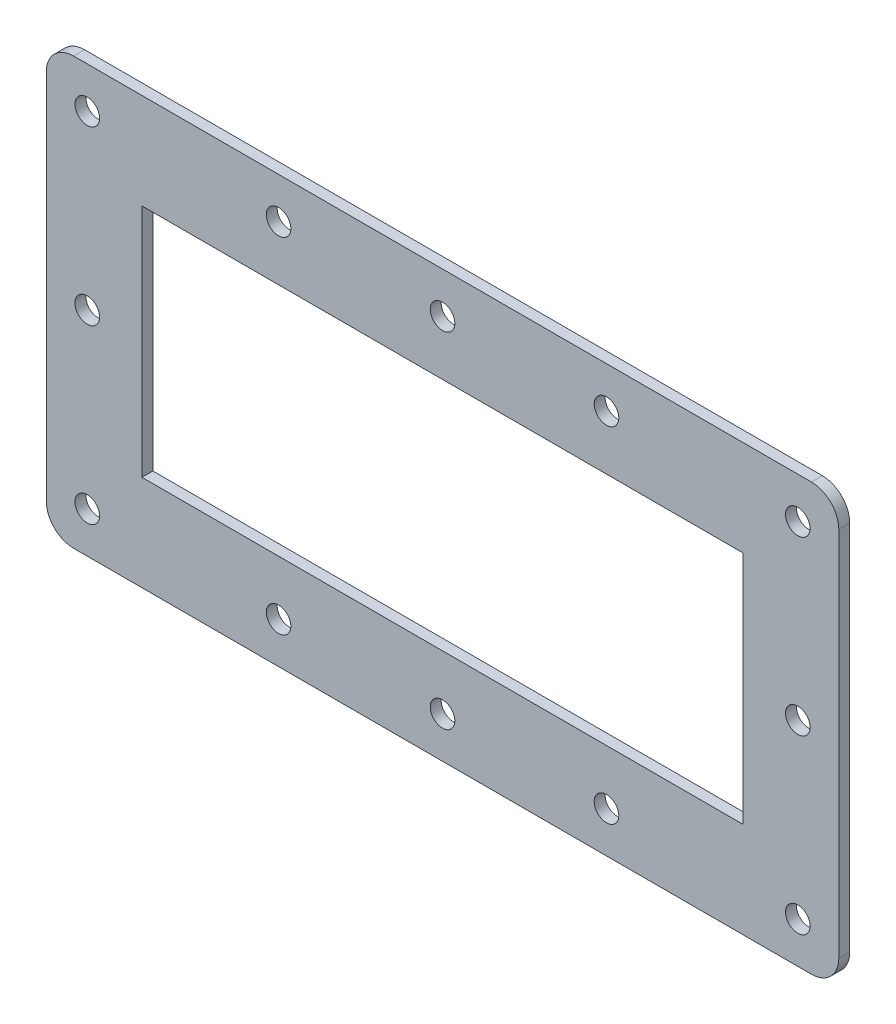
ISO-10303-21;
HEADER;
FILE_DESCRIPTION(('STEP AP214'),'2;1');
FILE_NAME('part.step','',(''),(''),'','','');
FILE_SCHEMA(('AUTOMOTIVE_DESIGN { 1 0 10303 214 1 1 1 1 }'));
ENDSEC;
DATA;
#1=APPLICATION_CONTEXT('core data for automotive mechanical design processes');
#2=APPLICATION_PROTOCOL_DEFINITION('international standard','automotive_design',2000,#1);
#3=PRODUCT_CONTEXT('',#1,'mechanical');
#4=PRODUCT('Part','Part','',(#3));
#5=PRODUCT_RELATED_PRODUCT_CATEGORY('part','',(#4));
#6=PRODUCT_DEFINITION_FORMATION('','',#4);
#7=PRODUCT_DEFINITION_CONTEXT('part definition',#1,'design');
#8=PRODUCT_DEFINITION('design','',#6,#7);
#9=PRODUCT_DEFINITION_SHAPE('','',#8);
#10=(LENGTH_UNIT() NAMED_UNIT(*) SI_UNIT(.MILLI.,.METRE.));
#11=(NAMED_UNIT(*) PLANE_ANGLE_UNIT() SI_UNIT($,.RADIAN.));
#12=(NAMED_UNIT(*) SI_UNIT($,.STERADIAN.) SOLID_ANGLE_UNIT());
#13=UNCERTAINTY_MEASURE_WITH_UNIT(LENGTH_MEASURE(1.E-05),#10,'distance_accuracy_value','');
#14=(GEOMETRIC_REPRESENTATION_CONTEXT(3) GLOBAL_UNCERTAINTY_ASSIGNED_CONTEXT((#13)) GLOBAL_UNIT_ASSIGNED_CONTEXT((#10,
#11,#12)) REPRESENTATION_CONTEXT('',''));
#15=CARTESIAN_POINT('',(0.,0.,0.));
#16=DIRECTION('',(0.,0.,1.));
#17=DIRECTION('',(1.,0.,0.));
#18=AXIS2_PLACEMENT_3D('',#15,#16,#17);
#19=CARTESIAN_POINT('',(-145.,-78.,-4.));
#20=DIRECTION('',(-1.,0.,0.));
#21=DIRECTION('',(0.,0.,1.));
#22=AXIS2_PLACEMENT_3D('',#19,#20,#21);
#23=PLANE('',#22);
#24=DIRECTION('',(0.,-1.,0.));
#25=VECTOR('',#24,1.);
#26=CARTESIAN_POINT('',(-145.,-78.,-4.));
#27=LINE('',#26,#25);
#28=CARTESIAN_POINT('',(-145.,68.,-4.));
#29=VERTEX_POINT('',#28);
#30=CARTESIAN_POINT('',(-145.,-68.,-4.));
#31=VERTEX_POINT('',#30);
#32=EDGE_CURVE('E174',#29,#31,#27,.T.);
#33=ORIENTED_EDGE('',*,*,#32,.T.);
#34=DIRECTION('',(0.,0.,1.));
#35=VECTOR('',#34,1.);
#36=CARTESIAN_POINT('',(-145.,-68.,-4.));
#37=LINE('',#36,#35);
#38=CARTESIAN_POINT('',(-145.,-68.,0.));
#39=VERTEX_POINT('',#38);
#40=EDGE_CURVE('E198',#31,#39,#37,.T.);
#41=ORIENTED_EDGE('',*,*,#40,.T.);
#42=DIRECTION('',(0.,-1.,0.));
#43=VECTOR('',#42,1.);
#44=CARTESIAN_POINT('',(-145.,-78.,0.));
#45=LINE('',#44,#43);
#46=CARTESIAN_POINT('',(-145.,68.,0.));
#47=VERTEX_POINT('',#46);
#48=EDGE_CURVE('E170',#47,#39,#45,.T.);
#49=ORIENTED_EDGE('',*,*,#48,.F.);
#50=DIRECTION('',(0.,0.,1.));
#51=VECTOR('',#50,1.);
#52=CARTESIAN_POINT('',(-145.,68.,-4.));
#53=LINE('',#52,#51);
#54=EDGE_CURVE('E186',#47,#29,#53,.F.);
#55=ORIENTED_EDGE('',*,*,#54,.T.);
#56=EDGE_LOOP('',(#33,#41,#49,#55));
#57=FACE_BOUND('',#56,.T.);
#58=ADVANCED_FACE('F38',(#57),#23,.T.);
#59=CARTESIAN_POINT('',(145.,78.,-4.));
#60=DIRECTION('',(0.,1.,0.));
#61=DIRECTION('',(0.,0.,1.));
#62=AXIS2_PLACEMENT_3D('',#59,#60,#61);
#63=PLANE('',#62);
#64=DIRECTION('',(-1.,0.,0.));
#65=VECTOR('',#64,1.);
#66=CARTESIAN_POINT('',(145.,78.,0.));
#67=LINE('',#66,#65);
#68=CARTESIAN_POINT('',(135.,78.,0.));
#69=VERTEX_POINT('',#68);
#70=CARTESIAN_POINT('',(-135.,78.,0.));
#71=VERTEX_POINT('',#70);
#72=EDGE_CURVE('E178',#69,#71,#67,.T.);
#73=ORIENTED_EDGE('',*,*,#72,.F.);
#74=DIRECTION('',(0.,0.,1.));
#75=VECTOR('',#74,1.);
#76=CARTESIAN_POINT('',(135.,78.,-4.));
#77=LINE('',#76,#75);
#78=CARTESIAN_POINT('',(135.,78.,-4.));
#79=VERTEX_POINT('',#78);
#80=EDGE_CURVE('E11',#69,#79,#77,.F.);
#81=ORIENTED_EDGE('',*,*,#80,.T.);
#82=DIRECTION('',(-1.,0.,0.));
#83=VECTOR('',#82,1.);
#84=CARTESIAN_POINT('',(145.,78.,-4.));
#85=LINE('',#84,#83);
#86=CARTESIAN_POINT('',(-135.,78.,-4.));
#87=VERTEX_POINT('',#86);
#88=EDGE_CURVE('E183',#79,#87,#85,.T.);
#89=ORIENTED_EDGE('',*,*,#88,.T.);
#90=DIRECTION('',(0.,0.,1.));
#91=VECTOR('',#90,1.);
#92=CARTESIAN_POINT('',(-135.,78.,-4.));
#93=LINE('',#92,#91);
#94=EDGE_CURVE('E46',#87,#71,#93,.T.);
#95=ORIENTED_EDGE('',*,*,#94,.T.);
#96=EDGE_LOOP('',(#73,#81,#89,#95));
#97=FACE_BOUND('',#96,.T.);
#98=ADVANCED_FACE('F228',(#97),#63,.T.);
#99=CARTESIAN_POINT('',(145.,-78.,-4.));
#100=DIRECTION('',(1.,0.,0.));
#101=DIRECTION('',(0.,0.,-1.));
#102=AXIS2_PLACEMENT_3D('',#99,#100,#101);
#103=PLANE('',#102);
#104=DIRECTION('',(0.,1.,0.));
#105=VECTOR('',#104,1.);
#106=CARTESIAN_POINT('',(145.,-78.,0.));
#107=LINE('',#106,#105);
#108=CARTESIAN_POINT('',(145.,-68.,0.));
#109=VERTEX_POINT('',#108);
#110=CARTESIAN_POINT('',(145.,68.,0.));
#111=VERTEX_POINT('',#110);
#112=EDGE_CURVE('E192',#109,#111,#107,.T.);
#113=ORIENTED_EDGE('',*,*,#112,.F.);
#114=DIRECTION('',(0.,0.,1.));
#115=VECTOR('',#114,1.);
#116=CARTESIAN_POINT('',(145.,-68.,-4.));
#117=LINE('',#116,#115);
#118=CARTESIAN_POINT('',(145.,-68.,-4.));
#119=VERTEX_POINT('',#118);
#120=EDGE_CURVE('E60',#109,#119,#117,.F.);
#121=ORIENTED_EDGE('',*,*,#120,.T.);
#122=DIRECTION('',(0.,1.,0.));
#123=VECTOR('',#122,1.);
#124=CARTESIAN_POINT('',(145.,-78.,-4.));
#125=LINE('',#124,#123);
#126=CARTESIAN_POINT('',(145.,68.,-4.));
#127=VERTEX_POINT('',#126);
#128=EDGE_CURVE('E181',#119,#127,#125,.T.);
#129=ORIENTED_EDGE('',*,*,#128,.T.);
#130=DIRECTION('',(0.,0.,1.));
#131=VECTOR('',#130,1.);
#132=CARTESIAN_POINT('',(145.,68.,-4.));
#133=LINE('',#132,#131);
#134=EDGE_CURVE('E221',#127,#111,#133,.T.);
#135=ORIENTED_EDGE('',*,*,#134,.T.);
#136=EDGE_LOOP('',(#113,#121,#129,#135));
#137=FACE_BOUND('',#136,.T.);
#138=ADVANCED_FACE('F238',(#137),#103,.T.);
#139=CARTESIAN_POINT('',(145.,-78.,-4.));
#140=DIRECTION('',(0.,-1.,0.));
#141=DIRECTION('',(0.,0.,-1.));
#142=AXIS2_PLACEMENT_3D('',#139,#140,#141);
#143=PLANE('',#142);
#144=DIRECTION('',(1.,0.,0.));
#145=VECTOR('',#144,1.);
#146=CARTESIAN_POINT('',(145.,-78.,0.));
#147=LINE('',#146,#145);
#148=CARTESIAN_POINT('',(-135.,-78.,0.));
#149=VERTEX_POINT('',#148);
#150=CARTESIAN_POINT('',(135.,-78.,0.));
#151=VERTEX_POINT('',#150);
#152=EDGE_CURVE('E189',#149,#151,#147,.T.);
#153=ORIENTED_EDGE('',*,*,#152,.F.);
#154=DIRECTION('',(0.,0.,1.));
#155=VECTOR('',#154,1.);
#156=CARTESIAN_POINT('',(-135.,-78.,-4.));
#157=LINE('',#156,#155);
#158=CARTESIAN_POINT('',(-135.,-78.,-4.));
#159=VERTEX_POINT('',#158);
#160=EDGE_CURVE('E212',#149,#159,#157,.F.);
#161=ORIENTED_EDGE('',*,*,#160,.T.);
#162=DIRECTION('',(1.,0.,0.));
#163=VECTOR('',#162,1.);
#164=CARTESIAN_POINT('',(145.,-78.,-4.));
#165=LINE('',#164,#163);
#166=CARTESIAN_POINT('',(135.,-78.,-4.));
#167=VERTEX_POINT('',#166);
#168=EDGE_CURVE('E177',#159,#167,#165,.T.);
#169=ORIENTED_EDGE('',*,*,#168,.T.);
#170=DIRECTION('',(0.,0.,1.));
#171=VECTOR('',#170,1.);
#172=CARTESIAN_POINT('',(135.,-78.,-4.));
#173=LINE('',#172,#171);
#174=EDGE_CURVE('E209',#167,#151,#173,.T.);
#175=ORIENTED_EDGE('',*,*,#174,.T.);
#176=EDGE_LOOP('',(#153,#161,#169,#175));
#177=FACE_BOUND('',#176,.T.);
#178=ADVANCED_FACE('F246',(#177),#143,.T.);
#179=CARTESIAN_POINT('',(0.,0.,-4.));
#180=DIRECTION('',(0.,0.,1.));
#181=DIRECTION('',(1.,0.,0.));
#182=AXIS2_PLACEMENT_3D('',#179,#180,#181);
#183=PLANE('',#182);
#184=CARTESIAN_POINT('',(-60.,63.,-4.));
#185=DIRECTION('',(0.,0.,1.));
#186=DIRECTION('',(1.,0.,0.));
#187=AXIS2_PLACEMENT_3D('',#184,#185,#186);
#188=CIRCLE('',#187,4.49999999999999);
#189=CARTESIAN_POINT('',(-55.5,63.,-4.));
#190=VERTEX_POINT('',#189);
#191=EDGE_CURVE('E611',#190,#190,#188,.T.);
#192=ORIENTED_EDGE('',*,*,#191,.T.);
#193=EDGE_LOOP('',(#192));
#194=FACE_BOUND('',#193,.T.);
#195=CARTESIAN_POINT('',(0.,63.,-4.));
#196=DIRECTION('',(0.,0.,1.));
#197=DIRECTION('',(1.,0.,0.));
#198=AXIS2_PLACEMENT_3D('',#195,#196,#197);
#199=CIRCLE('',#198,4.49999999999999);
#200=CARTESIAN_POINT('',(4.49999999999999,63.,-4.));
#201=VERTEX_POINT('',#200);
#202=EDGE_CURVE('E605',#201,#201,#199,.T.);
#203=ORIENTED_EDGE('',*,*,#202,.T.);
#204=EDGE_LOOP('',(#203));
#205=FACE_BOUND('',#204,.T.);
#206=CARTESIAN_POINT('',(60.,63.,-4.));
#207=DIRECTION('',(0.,0.,1.));
#208=DIRECTION('',(1.,0.,0.));
#209=AXIS2_PLACEMENT_3D('',#206,#207,#208);
#210=CIRCLE('',#209,4.49999999999999);
#211=CARTESIAN_POINT('',(64.5,63.,-4.));
#212=VERTEX_POINT('',#211);
#213=EDGE_CURVE('E599',#212,#212,#210,.T.);
#214=ORIENTED_EDGE('',*,*,#213,.T.);
#215=EDGE_LOOP('',(#214));
#216=FACE_BOUND('',#215,.T.);
#217=CARTESIAN_POINT('',(-60.,-63.,-4.));
#218=DIRECTION('',(0.,0.,1.));
#219=DIRECTION('',(1.,0.,0.));
#220=AXIS2_PLACEMENT_3D('',#217,#218,#219);
#221=CIRCLE('',#220,4.49999999999999);
#222=CARTESIAN_POINT('',(-55.5,-63.,-4.));
#223=VERTEX_POINT('',#222);
#224=EDGE_CURVE('E593',#223,#223,#221,.T.);
#225=ORIENTED_EDGE('',*,*,#224,.T.);
#226=EDGE_LOOP('',(#225));
#227=FACE_BOUND('',#226,.T.);
#228=CARTESIAN_POINT('',(0.,-63.,-4.));
#229=DIRECTION('',(0.,0.,1.));
#230=DIRECTION('',(1.,0.,0.));
#231=AXIS2_PLACEMENT_3D('',#228,#229,#230);
#232=CIRCLE('',#231,4.49999999999999);
#233=CARTESIAN_POINT('',(4.49999999999999,-63.,-4.));
#234=VERTEX_POINT('',#233);
#235=EDGE_CURVE('E587',#234,#234,#232,.T.);
#236=ORIENTED_EDGE('',*,*,#235,.T.);
#237=EDGE_LOOP('',(#236));
#238=FACE_BOUND('',#237,.T.);
#239=CARTESIAN_POINT('',(60.,-63.,-4.));
#240=DIRECTION('',(0.,0.,1.));
#241=DIRECTION('',(1.,0.,0.));
#242=AXIS2_PLACEMENT_3D('',#239,#240,#241);
#243=CIRCLE('',#242,4.49999999999999);
#244=CARTESIAN_POINT('',(64.5,-63.,-4.));
#245=VERTEX_POINT('',#244);
#246=EDGE_CURVE('E581',#245,#245,#243,.T.);
#247=ORIENTED_EDGE('',*,*,#246,.T.);
#248=EDGE_LOOP('',(#247));
#249=FACE_BOUND('',#248,.T.);
#250=CARTESIAN_POINT('',(130.,63.,-4.));
#251=DIRECTION('',(0.,0.,1.));
#252=DIRECTION('',(1.,0.,0.));
#253=AXIS2_PLACEMENT_3D('',#250,#251,#252);
#254=CIRCLE('',#253,4.5);
#255=CARTESIAN_POINT('',(134.5,63.,-4.));
#256=VERTEX_POINT('',#255);
#257=EDGE_CURVE('E575',#256,#256,#254,.T.);
#258=ORIENTED_EDGE('',*,*,#257,.T.);
#259=EDGE_LOOP('',(#258));
#260=FACE_BOUND('',#259,.T.);
#261=CARTESIAN_POINT('',(130.,0.,-4.));
#262=DIRECTION('',(0.,0.,1.));
#263=DIRECTION('',(1.,0.,0.));
#264=AXIS2_PLACEMENT_3D('',#261,#262,#263);
#265=CIRCLE('',#264,4.5);
#266=CARTESIAN_POINT('',(134.5,0.,-4.));
#267=VERTEX_POINT('',#266);
#268=EDGE_CURVE('E569',#267,#267,#265,.T.);
#269=ORIENTED_EDGE('',*,*,#268,.T.);
#270=EDGE_LOOP('',(#269));
#271=FACE_BOUND('',#270,.T.);
#272=CARTESIAN_POINT('',(130.,-63.,-4.));
#273=DIRECTION('',(0.,0.,1.));
#274=DIRECTION('',(1.,0.,0.));
#275=AXIS2_PLACEMENT_3D('',#272,#273,#274);
#276=CIRCLE('',#275,4.5);
#277=CARTESIAN_POINT('',(134.5,-63.,-4.));
#278=VERTEX_POINT('',#277);
#279=EDGE_CURVE('E563',#278,#278,#276,.T.);
#280=ORIENTED_EDGE('',*,*,#279,.T.);
#281=EDGE_LOOP('',(#280));
#282=FACE_BOUND('',#281,.T.);
#283=CARTESIAN_POINT('',(-130.,63.,-4.));
#284=DIRECTION('',(0.,0.,1.));
#285=DIRECTION('',(1.,0.,0.));
#286=AXIS2_PLACEMENT_3D('',#283,#284,#285);
#287=CIRCLE('',#286,4.5);
#288=CARTESIAN_POINT('',(-125.5,63.,-4.));
#289=VERTEX_POINT('',#288);
#290=EDGE_CURVE('E543',#289,#289,#287,.T.);
#291=ORIENTED_EDGE('',*,*,#290,.T.);
#292=EDGE_LOOP('',(#291));
#293=FACE_BOUND('',#292,.T.);
#294=CARTESIAN_POINT('',(-130.,0.,-4.));
#295=DIRECTION('',(0.,0.,1.));
#296=DIRECTION('',(1.,0.,0.));
#297=AXIS2_PLACEMENT_3D('',#294,#295,#296);
#298=CIRCLE('',#297,4.5);
#299=CARTESIAN_POINT('',(-125.5,0.,-4.));
#300=VERTEX_POINT('',#299);
#301=EDGE_CURVE('E538',#300,#300,#298,.T.);
#302=ORIENTED_EDGE('',*,*,#301,.T.);
#303=EDGE_LOOP('',(#302));
#304=FACE_BOUND('',#303,.T.);
#305=CARTESIAN_POINT('',(-130.,-63.,-4.));
#306=DIRECTION('',(0.,0.,1.));
#307=DIRECTION('',(1.,0.,0.));
#308=AXIS2_PLACEMENT_3D('',#305,#306,#307);
#309=CIRCLE('',#308,4.5);
#310=CARTESIAN_POINT('',(-125.5,-63.,-4.));
#311=VERTEX_POINT('',#310);
#312=EDGE_CURVE('E158',#311,#311,#309,.T.);
#313=ORIENTED_EDGE('',*,*,#312,.T.);
#314=EDGE_LOOP('',(#313));
#315=FACE_BOUND('',#314,.T.);
#316=DIRECTION('',(-1.,0.,0.));
#317=VECTOR('',#316,1.);
#318=CARTESIAN_POINT('',(110.,43.,-4.));
#319=LINE('',#318,#317);
#320=CARTESIAN_POINT('',(110.,43.,-4.));
#321=VERTEX_POINT('',#320);
#322=CARTESIAN_POINT('',(-110.,43.,-4.));
#323=VERTEX_POINT('',#322);
#324=EDGE_CURVE('E140',#321,#323,#319,.T.);
#325=ORIENTED_EDGE('',*,*,#324,.T.);
#326=DIRECTION('',(0.,-1.,0.));
#327=VECTOR('',#326,1.);
#328=CARTESIAN_POINT('',(-110.,-43.,-4.));
#329=LINE('',#328,#327);
#330=CARTESIAN_POINT('',(-110.,-43.,-4.));
#331=VERTEX_POINT('',#330);
#332=EDGE_CURVE('E132',#323,#331,#329,.T.);
#333=ORIENTED_EDGE('',*,*,#332,.T.);
#334=DIRECTION('',(1.,0.,0.));
#335=VECTOR('',#334,1.);
#336=CARTESIAN_POINT('',(110.,-43.,-4.));
#337=LINE('',#336,#335);
#338=CARTESIAN_POINT('',(110.,-43.,-4.));
#339=VERTEX_POINT('',#338);
#340=EDGE_CURVE('E144',#331,#339,#337,.T.);
#341=ORIENTED_EDGE('',*,*,#340,.T.);
#342=DIRECTION('',(0.,1.,0.));
#343=VECTOR('',#342,1.);
#344=CARTESIAN_POINT('',(110.,-43.,-4.));
#345=LINE('',#344,#343);
#346=EDGE_CURVE('E148',#339,#321,#345,.T.);
#347=ORIENTED_EDGE('',*,*,#346,.T.);
#348=EDGE_LOOP('',(#325,#333,#341,#347));
#349=FACE_BOUND('',#348,.T.);
#350=ORIENTED_EDGE('',*,*,#168,.F.);
#351=CARTESIAN_POINT('',(-135.,-68.,-4.));
#352=DIRECTION('',(0.,0.,1.));
#353=DIRECTION('',(1.,0.,0.));
#354=AXIS2_PLACEMENT_3D('',#351,#352,#353);
#355=CIRCLE('',#354,10.);
#356=EDGE_CURVE('E219',#159,#31,#355,.F.);
#357=ORIENTED_EDGE('',*,*,#356,.T.);
#358=ORIENTED_EDGE('',*,*,#32,.F.);
#359=CARTESIAN_POINT('',(-135.,68.,-4.));
#360=DIRECTION('',(0.,0.,1.));
#361=DIRECTION('',(1.,0.,0.));
#362=AXIS2_PLACEMENT_3D('',#359,#360,#361);
#363=CIRCLE('',#362,10.);
#364=EDGE_CURVE('E214',#29,#87,#363,.F.);
#365=ORIENTED_EDGE('',*,*,#364,.T.);
#366=ORIENTED_EDGE('',*,*,#88,.F.);
#367=CARTESIAN_POINT('',(135.,68.,-4.));
#368=DIRECTION('',(0.,0.,1.));
#369=DIRECTION('',(1.,0.,0.));
#370=AXIS2_PLACEMENT_3D('',#367,#368,#369);
#371=CIRCLE('',#370,10.);
#372=EDGE_CURVE('E53',#79,#127,#371,.F.);
#373=ORIENTED_EDGE('',*,*,#372,.T.);
#374=ORIENTED_EDGE('',*,*,#128,.F.);
#375=CARTESIAN_POINT('',(135.,-68.,-4.));
#376=DIRECTION('',(0.,0.,1.));
#377=DIRECTION('',(1.,0.,0.));
#378=AXIS2_PLACEMENT_3D('',#375,#376,#377);
#379=CIRCLE('',#378,10.);
#380=EDGE_CURVE('E217',#119,#167,#379,.F.);
#381=ORIENTED_EDGE('',*,*,#380,.T.);
#382=EDGE_LOOP('',(#350,#357,#358,#365,#366,#373,#374,#381));
#383=FACE_BOUND('',#382,.T.);
#384=ADVANCED_FACE('F150',(#194,#205,#216,#227,#238,#249,#260,#271,#282,#293,#304,#315,#349,
#383),#183,.F.);
#385=CARTESIAN_POINT('',(0.,0.,0.));
#386=DIRECTION('',(0.,0.,1.));
#387=DIRECTION('',(1.,0.,0.));
#388=AXIS2_PLACEMENT_3D('',#385,#386,#387);
#389=PLANE('',#388);
#390=CARTESIAN_POINT('',(-60.,63.,0.));
#391=DIRECTION('',(0.,0.,1.));
#392=DIRECTION('',(1.,0.,0.));
#393=AXIS2_PLACEMENT_3D('',#390,#391,#392);
#394=CIRCLE('',#393,4.49999999999999);
#395=CARTESIAN_POINT('',(-55.5,63.,0.));
#396=VERTEX_POINT('',#395);
#397=EDGE_CURVE('E614',#396,#396,#394,.T.);
#398=ORIENTED_EDGE('',*,*,#397,.F.);
#399=EDGE_LOOP('',(#398));
#400=FACE_BOUND('',#399,.T.);
#401=CARTESIAN_POINT('',(0.,63.,0.));
#402=DIRECTION('',(0.,0.,1.));
#403=DIRECTION('',(1.,0.,0.));
#404=AXIS2_PLACEMENT_3D('',#401,#402,#403);
#405=CIRCLE('',#404,4.49999999999999);
#406=CARTESIAN_POINT('',(4.49999999999999,63.,0.));
#407=VERTEX_POINT('',#406);
#408=EDGE_CURVE('E608',#407,#407,#405,.T.);
#409=ORIENTED_EDGE('',*,*,#408,.F.);
#410=EDGE_LOOP('',(#409));
#411=FACE_BOUND('',#410,.T.);
#412=CARTESIAN_POINT('',(60.,63.,0.));
#413=DIRECTION('',(0.,0.,1.));
#414=DIRECTION('',(1.,0.,0.));
#415=AXIS2_PLACEMENT_3D('',#412,#413,#414);
#416=CIRCLE('',#415,4.49999999999999);
#417=CARTESIAN_POINT('',(64.5,63.,0.));
#418=VERTEX_POINT('',#417);
#419=EDGE_CURVE('E602',#418,#418,#416,.T.);
#420=ORIENTED_EDGE('',*,*,#419,.F.);
#421=EDGE_LOOP('',(#420));
#422=FACE_BOUND('',#421,.T.);
#423=CARTESIAN_POINT('',(-60.,-63.,0.));
#424=DIRECTION('',(0.,0.,1.));
#425=DIRECTION('',(1.,0.,0.));
#426=AXIS2_PLACEMENT_3D('',#423,#424,#425);
#427=CIRCLE('',#426,4.49999999999999);
#428=CARTESIAN_POINT('',(-55.5,-63.,0.));
#429=VERTEX_POINT('',#428);
#430=EDGE_CURVE('E596',#429,#429,#427,.T.);
#431=ORIENTED_EDGE('',*,*,#430,.F.);
#432=EDGE_LOOP('',(#431));
#433=FACE_BOUND('',#432,.T.);
#434=CARTESIAN_POINT('',(0.,-63.,0.));
#435=DIRECTION('',(0.,0.,1.));
#436=DIRECTION('',(1.,0.,0.));
#437=AXIS2_PLACEMENT_3D('',#434,#435,#436);
#438=CIRCLE('',#437,4.49999999999999);
#439=CARTESIAN_POINT('',(4.49999999999999,-63.,0.));
#440=VERTEX_POINT('',#439);
#441=EDGE_CURVE('E590',#440,#440,#438,.T.);
#442=ORIENTED_EDGE('',*,*,#441,.F.);
#443=EDGE_LOOP('',(#442));
#444=FACE_BOUND('',#443,.T.);
#445=CARTESIAN_POINT('',(60.,-63.,0.));
#446=DIRECTION('',(0.,0.,1.));
#447=DIRECTION('',(1.,0.,0.));
#448=AXIS2_PLACEMENT_3D('',#445,#446,#447);
#449=CIRCLE('',#448,4.49999999999999);
#450=CARTESIAN_POINT('',(64.5,-63.,0.));
#451=VERTEX_POINT('',#450);
#452=EDGE_CURVE('E584',#451,#451,#449,.T.);
#453=ORIENTED_EDGE('',*,*,#452,.F.);
#454=EDGE_LOOP('',(#453));
#455=FACE_BOUND('',#454,.T.);
#456=CARTESIAN_POINT('',(130.,63.,0.));
#457=DIRECTION('',(0.,0.,1.));
#458=DIRECTION('',(1.,0.,0.));
#459=AXIS2_PLACEMENT_3D('',#456,#457,#458);
#460=CIRCLE('',#459,4.5);
#461=CARTESIAN_POINT('',(134.5,63.,0.));
#462=VERTEX_POINT('',#461);
#463=EDGE_CURVE('E578',#462,#462,#460,.T.);
#464=ORIENTED_EDGE('',*,*,#463,.F.);
#465=EDGE_LOOP('',(#464));
#466=FACE_BOUND('',#465,.T.);
#467=CARTESIAN_POINT('',(130.,0.,0.));
#468=DIRECTION('',(0.,0.,1.));
#469=DIRECTION('',(1.,0.,0.));
#470=AXIS2_PLACEMENT_3D('',#467,#468,#469);
#471=CIRCLE('',#470,4.5);
#472=CARTESIAN_POINT('',(134.5,0.,0.));
#473=VERTEX_POINT('',#472);
#474=EDGE_CURVE('E572',#473,#473,#471,.T.);
#475=ORIENTED_EDGE('',*,*,#474,.F.);
#476=EDGE_LOOP('',(#475));
#477=FACE_BOUND('',#476,.T.);
#478=CARTESIAN_POINT('',(130.,-63.,0.));
#479=DIRECTION('',(0.,0.,1.));
#480=DIRECTION('',(1.,0.,0.));
#481=AXIS2_PLACEMENT_3D('',#478,#479,#480);
#482=CIRCLE('',#481,4.5);
#483=CARTESIAN_POINT('',(134.5,-63.,0.));
#484=VERTEX_POINT('',#483);
#485=EDGE_CURVE('E566',#484,#484,#482,.T.);
#486=ORIENTED_EDGE('',*,*,#485,.F.);
#487=EDGE_LOOP('',(#486));
#488=FACE_BOUND('',#487,.T.);
#489=CARTESIAN_POINT('',(-130.,63.,0.));
#490=DIRECTION('',(0.,0.,1.));
#491=DIRECTION('',(1.,0.,0.));
#492=AXIS2_PLACEMENT_3D('',#489,#490,#491);
#493=CIRCLE('',#492,4.5);
#494=CARTESIAN_POINT('',(-125.5,63.,0.));
#495=VERTEX_POINT('',#494);
#496=EDGE_CURVE('E548',#495,#495,#493,.T.);
#497=ORIENTED_EDGE('',*,*,#496,.F.);
#498=EDGE_LOOP('',(#497));
#499=FACE_BOUND('',#498,.T.);
#500=CARTESIAN_POINT('',(-130.,0.,0.));
#501=DIRECTION('',(0.,0.,1.));
#502=DIRECTION('',(1.,0.,0.));
#503=AXIS2_PLACEMENT_3D('',#500,#501,#502);
#504=CIRCLE('',#503,4.5);
#505=CARTESIAN_POINT('',(-125.5,0.,0.));
#506=VERTEX_POINT('',#505);
#507=EDGE_CURVE('E541',#506,#506,#504,.T.);
#508=ORIENTED_EDGE('',*,*,#507,.F.);
#509=EDGE_LOOP('',(#508));
#510=FACE_BOUND('',#509,.T.);
#511=CARTESIAN_POINT('',(-130.,-63.,0.));
#512=DIRECTION('',(0.,0.,1.));
#513=DIRECTION('',(1.,0.,0.));
#514=AXIS2_PLACEMENT_3D('',#511,#512,#513);
#515=CIRCLE('',#514,4.5);
#516=CARTESIAN_POINT('',(-125.5,-63.,0.));
#517=VERTEX_POINT('',#516);
#518=EDGE_CURVE('E545',#517,#517,#515,.T.);
#519=ORIENTED_EDGE('',*,*,#518,.F.);
#520=EDGE_LOOP('',(#519));
#521=FACE_BOUND('',#520,.T.);
#522=DIRECTION('',(0.,-1.,0.));
#523=VECTOR('',#522,1.);
#524=CARTESIAN_POINT('',(-110.,-43.,0.));
#525=LINE('',#524,#523);
#526=CARTESIAN_POINT('',(-110.,43.,0.));
#527=VERTEX_POINT('',#526);
#528=CARTESIAN_POINT('',(-110.,-43.,0.));
#529=VERTEX_POINT('',#528);
#530=EDGE_CURVE('E135',#527,#529,#525,.T.);
#531=ORIENTED_EDGE('',*,*,#530,.F.);
#532=DIRECTION('',(-1.,0.,0.));
#533=VECTOR('',#532,1.);
#534=CARTESIAN_POINT('',(110.,43.,0.));
#535=LINE('',#534,#533);
#536=CARTESIAN_POINT('',(110.,43.,0.));
#537=VERTEX_POINT('',#536);
#538=EDGE_CURVE('E152',#537,#527,#535,.T.);
#539=ORIENTED_EDGE('',*,*,#538,.F.);
#540=DIRECTION('',(0.,1.,0.));
#541=VECTOR('',#540,1.);
#542=CARTESIAN_POINT('',(110.,-43.,0.));
#543=LINE('',#542,#541);
#544=CARTESIAN_POINT('',(110.,-43.,0.));
#545=VERTEX_POINT('',#544);
#546=EDGE_CURVE('E155',#545,#537,#543,.T.);
#547=ORIENTED_EDGE('',*,*,#546,.F.);
#548=DIRECTION('',(1.,0.,0.));
#549=VECTOR('',#548,1.);
#550=CARTESIAN_POINT('',(110.,-43.,0.));
#551=LINE('',#550,#549);
#552=EDGE_CURVE('E164',#529,#545,#551,.T.);
#553=ORIENTED_EDGE('',*,*,#552,.F.);
#554=EDGE_LOOP('',(#531,#539,#547,#553));
#555=FACE_BOUND('',#554,.T.);
#556=ORIENTED_EDGE('',*,*,#48,.T.);
#557=CARTESIAN_POINT('',(-135.,-68.,0.));
#558=DIRECTION('',(0.,0.,1.));
#559=DIRECTION('',(1.,0.,0.));
#560=AXIS2_PLACEMENT_3D('',#557,#558,#559);
#561=CIRCLE('',#560,10.);
#562=EDGE_CURVE('E207',#39,#149,#561,.T.);
#563=ORIENTED_EDGE('',*,*,#562,.T.);
#564=ORIENTED_EDGE('',*,*,#152,.T.);
#565=CARTESIAN_POINT('',(135.,-68.,0.));
#566=DIRECTION('',(0.,0.,1.));
#567=DIRECTION('',(1.,0.,0.));
#568=AXIS2_PLACEMENT_3D('',#565,#566,#567);
#569=CIRCLE('',#568,10.);
#570=EDGE_CURVE('E205',#151,#109,#569,.T.);
#571=ORIENTED_EDGE('',*,*,#570,.T.);
#572=ORIENTED_EDGE('',*,*,#112,.T.);
#573=CARTESIAN_POINT('',(135.,68.,0.));
#574=DIRECTION('',(0.,0.,1.));
#575=DIRECTION('',(1.,0.,0.));
#576=AXIS2_PLACEMENT_3D('',#573,#574,#575);
#577=CIRCLE('',#576,10.);
#578=EDGE_CURVE('E203',#111,#69,#577,.T.);
#579=ORIENTED_EDGE('',*,*,#578,.T.);
#580=ORIENTED_EDGE('',*,*,#72,.T.);
#581=CARTESIAN_POINT('',(-135.,68.,0.));
#582=DIRECTION('',(0.,0.,1.));
#583=DIRECTION('',(1.,0.,0.));
#584=AXIS2_PLACEMENT_3D('',#581,#582,#583);
#585=CIRCLE('',#584,10.);
#586=EDGE_CURVE('E201',#71,#47,#585,.T.);
#587=ORIENTED_EDGE('',*,*,#586,.T.);
#588=EDGE_LOOP('',(#556,#563,#564,#571,#572,#579,#580,#587));
#589=FACE_BOUND('',#588,.T.);
#590=ADVANCED_FACE('F233',(#400,#411,#422,#433,#444,#455,#466,#477,#488,#499,#510,#521,#555,
#589),#389,.T.);
#591=CARTESIAN_POINT('',(-110.,-43.,-4.));
#592=DIRECTION('',(-1.,0.,0.));
#593=DIRECTION('',(0.,0.,1.));
#594=AXIS2_PLACEMENT_3D('',#591,#592,#593);
#595=PLANE('',#594);
#596=ORIENTED_EDGE('',*,*,#530,.T.);
#597=DIRECTION('',(0.,0.,1.));
#598=VECTOR('',#597,1.);
#599=CARTESIAN_POINT('',(-110.,-43.,-4.));
#600=LINE('',#599,#598);
#601=EDGE_CURVE('E128',#331,#529,#600,.T.);
#602=ORIENTED_EDGE('',*,*,#601,.F.);
#603=ORIENTED_EDGE('',*,*,#332,.F.);
#604=DIRECTION('',(0.,0.,1.));
#605=VECTOR('',#604,1.);
#606=CARTESIAN_POINT('',(-110.,43.,-4.));
#607=LINE('',#606,#605);
#608=EDGE_CURVE('E168',#323,#527,#607,.T.);
#609=ORIENTED_EDGE('',*,*,#608,.T.);
#610=EDGE_LOOP('',(#596,#602,#603,#609));
#611=FACE_BOUND('',#610,.T.);
#612=ADVANCED_FACE('F130',(#611),#595,.F.);
#613=CARTESIAN_POINT('',(110.,43.,-4.));
#614=DIRECTION('',(0.,1.,0.));
#615=DIRECTION('',(-1.,0.,0.));
#616=AXIS2_PLACEMENT_3D('',#613,#614,#615);
#617=PLANE('',#616);
#618=ORIENTED_EDGE('',*,*,#538,.T.);
#619=ORIENTED_EDGE('',*,*,#608,.F.);
#620=ORIENTED_EDGE('',*,*,#324,.F.);
#621=DIRECTION('',(0.,0.,1.));
#622=VECTOR('',#621,1.);
#623=CARTESIAN_POINT('',(110.,43.,-4.));
#624=LINE('',#623,#622);
#625=EDGE_CURVE('E171',#321,#537,#624,.T.);
#626=ORIENTED_EDGE('',*,*,#625,.T.);
#627=EDGE_LOOP('',(#618,#619,#620,#626));
#628=FACE_BOUND('',#627,.T.);
#629=ADVANCED_FACE('F329',(#628),#617,.F.);
#630=CARTESIAN_POINT('',(110.,-43.,-4.));
#631=DIRECTION('',(1.,0.,0.));
#632=DIRECTION('',(0.,0.,-1.));
#633=AXIS2_PLACEMENT_3D('',#630,#631,#632);
#634=PLANE('',#633);
#635=ORIENTED_EDGE('',*,*,#546,.T.);
#636=ORIENTED_EDGE('',*,*,#625,.F.);
#637=ORIENTED_EDGE('',*,*,#346,.F.);
#638=DIRECTION('',(0.,0.,1.));
#639=VECTOR('',#638,1.);
#640=CARTESIAN_POINT('',(110.,-43.,-4.));
#641=LINE('',#640,#639);
#642=EDGE_CURVE('E139',#339,#545,#641,.T.);
#643=ORIENTED_EDGE('',*,*,#642,.T.);
#644=EDGE_LOOP('',(#635,#636,#637,#643));
#645=FACE_BOUND('',#644,.T.);
#646=ADVANCED_FACE('F320',(#645),#634,.F.);
#647=CARTESIAN_POINT('',(110.,-43.,-4.));
#648=DIRECTION('',(0.,-1.,0.));
#649=DIRECTION('',(1.,0.,0.));
#650=AXIS2_PLACEMENT_3D('',#647,#648,#649);
#651=PLANE('',#650);
#652=ORIENTED_EDGE('',*,*,#552,.T.);
#653=ORIENTED_EDGE('',*,*,#642,.F.);
#654=ORIENTED_EDGE('',*,*,#340,.F.);
#655=ORIENTED_EDGE('',*,*,#601,.T.);
#656=EDGE_LOOP('',(#652,#653,#654,#655));
#657=FACE_BOUND('',#656,.T.);
#658=ADVANCED_FACE('F145',(#657),#651,.F.);
#659=CARTESIAN_POINT('',(-135.,-68.,-4.));
#660=DIRECTION('',(0.,0.,1.));
#661=DIRECTION('',(1.,0.,0.));
#662=AXIS2_PLACEMENT_3D('',#659,#660,#661);
#663=CYLINDRICAL_SURFACE('',#662,10.);
#664=ORIENTED_EDGE('',*,*,#356,.F.);
#665=ORIENTED_EDGE('',*,*,#160,.F.);
#666=ORIENTED_EDGE('',*,*,#562,.F.);
#667=ORIENTED_EDGE('',*,*,#40,.F.);
#668=EDGE_LOOP('',(#664,#665,#666,#667));
#669=FACE_BOUND('',#668,.T.);
#670=ADVANCED_FACE('F251',(#669),#663,.T.);
#671=CARTESIAN_POINT('',(135.,-68.,-4.));
#672=DIRECTION('',(0.,0.,1.));
#673=DIRECTION('',(1.,0.,0.));
#674=AXIS2_PLACEMENT_3D('',#671,#672,#673);
#675=CYLINDRICAL_SURFACE('',#674,10.);
#676=ORIENTED_EDGE('',*,*,#380,.F.);
#677=ORIENTED_EDGE('',*,*,#120,.F.);
#678=ORIENTED_EDGE('',*,*,#570,.F.);
#679=ORIENTED_EDGE('',*,*,#174,.F.);
#680=EDGE_LOOP('',(#676,#677,#678,#679));
#681=FACE_BOUND('',#680,.T.);
#682=ADVANCED_FACE('F243',(#681),#675,.T.);
#683=CARTESIAN_POINT('',(135.,68.,-4.));
#684=DIRECTION('',(0.,0.,1.));
#685=DIRECTION('',(1.,0.,0.));
#686=AXIS2_PLACEMENT_3D('',#683,#684,#685);
#687=CYLINDRICAL_SURFACE('',#686,10.);
#688=ORIENTED_EDGE('',*,*,#372,.F.);
#689=ORIENTED_EDGE('',*,*,#80,.F.);
#690=ORIENTED_EDGE('',*,*,#578,.F.);
#691=ORIENTED_EDGE('',*,*,#134,.F.);
#692=EDGE_LOOP('',(#688,#689,#690,#691));
#693=FACE_BOUND('',#692,.T.);
#694=ADVANCED_FACE('F237',(#693),#687,.T.);
#695=CARTESIAN_POINT('',(-135.,68.,-4.));
#696=DIRECTION('',(0.,0.,1.));
#697=DIRECTION('',(1.,0.,0.));
#698=AXIS2_PLACEMENT_3D('',#695,#696,#697);
#699=CYLINDRICAL_SURFACE('',#698,10.);
#700=ORIENTED_EDGE('',*,*,#364,.F.);
#701=ORIENTED_EDGE('',*,*,#54,.F.);
#702=ORIENTED_EDGE('',*,*,#586,.F.);
#703=ORIENTED_EDGE('',*,*,#94,.F.);
#704=EDGE_LOOP('',(#700,#701,#702,#703));
#705=FACE_BOUND('',#704,.T.);
#706=ADVANCED_FACE('F40',(#705),#699,.T.);
#707=CARTESIAN_POINT('',(-130.,-63.,0.));
#708=DIRECTION('',(0.,0.,1.));
#709=DIRECTION('',(1.,0.,0.));
#710=AXIS2_PLACEMENT_3D('',#707,#708,#709);
#711=CYLINDRICAL_SURFACE('',#710,4.5);
#712=ORIENTED_EDGE('',*,*,#312,.F.);
#713=EDGE_LOOP('',(#712));
#714=FACE_BOUND('',#713,.T.);
#715=ORIENTED_EDGE('',*,*,#518,.T.);
#716=EDGE_LOOP('',(#715));
#717=FACE_BOUND('',#716,.T.);
#718=ADVANCED_FACE('F256',(#714,#717),#711,.F.);
#719=CARTESIAN_POINT('',(-130.,0.,0.));
#720=DIRECTION('',(0.,0.,1.));
#721=DIRECTION('',(1.,0.,0.));
#722=AXIS2_PLACEMENT_3D('',#719,#720,#721);
#723=CYLINDRICAL_SURFACE('',#722,4.5);
#724=ORIENTED_EDGE('',*,*,#301,.F.);
#725=EDGE_LOOP('',(#724));
#726=FACE_BOUND('',#725,.T.);
#727=ORIENTED_EDGE('',*,*,#507,.T.);
#728=EDGE_LOOP('',(#727));
#729=FACE_BOUND('',#728,.T.);
#730=ADVANCED_FACE('F262',(#726,#729),#723,.F.);
#731=CARTESIAN_POINT('',(-130.,63.,0.));
#732=DIRECTION('',(0.,0.,1.));
#733=DIRECTION('',(1.,0.,0.));
#734=AXIS2_PLACEMENT_3D('',#731,#732,#733);
#735=CYLINDRICAL_SURFACE('',#734,4.5);
#736=ORIENTED_EDGE('',*,*,#290,.F.);
#737=EDGE_LOOP('',(#736));
#738=FACE_BOUND('',#737,.T.);
#739=ORIENTED_EDGE('',*,*,#496,.T.);
#740=EDGE_LOOP('',(#739));
#741=FACE_BOUND('',#740,.T.);
#742=ADVANCED_FACE('F486',(#738,#741),#735,.F.);
#743=CARTESIAN_POINT('',(130.,-63.,0.));
#744=DIRECTION('',(0.,0.,1.));
#745=DIRECTION('',(1.,0.,0.));
#746=AXIS2_PLACEMENT_3D('',#743,#744,#745);
#747=CYLINDRICAL_SURFACE('',#746,4.5);
#748=ORIENTED_EDGE('',*,*,#279,.F.);
#749=EDGE_LOOP('',(#748));
#750=FACE_BOUND('',#749,.T.);
#751=ORIENTED_EDGE('',*,*,#485,.T.);
#752=EDGE_LOOP('',(#751));
#753=FACE_BOUND('',#752,.T.);
#754=ADVANCED_FACE('F476',(#750,#753),#747,.F.);
#755=CARTESIAN_POINT('',(130.,0.,0.));
#756=DIRECTION('',(0.,0.,1.));
#757=DIRECTION('',(1.,0.,0.));
#758=AXIS2_PLACEMENT_3D('',#755,#756,#757);
#759=CYLINDRICAL_SURFACE('',#758,4.5);
#760=ORIENTED_EDGE('',*,*,#268,.F.);
#761=EDGE_LOOP('',(#760));
#762=FACE_BOUND('',#761,.T.);
#763=ORIENTED_EDGE('',*,*,#474,.T.);
#764=EDGE_LOOP('',(#763));
#765=FACE_BOUND('',#764,.T.);
#766=ADVANCED_FACE('F466',(#762,#765),#759,.F.);
#767=CARTESIAN_POINT('',(130.,63.,0.));
#768=DIRECTION('',(0.,0.,1.));
#769=DIRECTION('',(1.,0.,0.));
#770=AXIS2_PLACEMENT_3D('',#767,#768,#769);
#771=CYLINDRICAL_SURFACE('',#770,4.5);
#772=ORIENTED_EDGE('',*,*,#257,.F.);
#773=EDGE_LOOP('',(#772));
#774=FACE_BOUND('',#773,.T.);
#775=ORIENTED_EDGE('',*,*,#463,.T.);
#776=EDGE_LOOP('',(#775));
#777=FACE_BOUND('',#776,.T.);
#778=ADVANCED_FACE('F456',(#774,#777),#771,.F.);
#779=CARTESIAN_POINT('',(60.,-63.,0.));
#780=DIRECTION('',(0.,0.,1.));
#781=DIRECTION('',(1.,0.,0.));
#782=AXIS2_PLACEMENT_3D('',#779,#780,#781);
#783=CYLINDRICAL_SURFACE('',#782,4.49999999999999);
#784=ORIENTED_EDGE('',*,*,#246,.F.);
#785=EDGE_LOOP('',(#784));
#786=FACE_BOUND('',#785,.T.);
#787=ORIENTED_EDGE('',*,*,#452,.T.);
#788=EDGE_LOOP('',(#787));
#789=FACE_BOUND('',#788,.T.);
#790=ADVANCED_FACE('F446',(#786,#789),#783,.F.);
#791=CARTESIAN_POINT('',(0.,-63.,0.));
#792=DIRECTION('',(0.,0.,1.));
#793=DIRECTION('',(1.,0.,0.));
#794=AXIS2_PLACEMENT_3D('',#791,#792,#793);
#795=CYLINDRICAL_SURFACE('',#794,4.49999999999999);
#796=ORIENTED_EDGE('',*,*,#235,.F.);
#797=EDGE_LOOP('',(#796));
#798=FACE_BOUND('',#797,.T.);
#799=ORIENTED_EDGE('',*,*,#441,.T.);
#800=EDGE_LOOP('',(#799));
#801=FACE_BOUND('',#800,.T.);
#802=ADVANCED_FACE('F436',(#798,#801),#795,.F.);
#803=CARTESIAN_POINT('',(-60.,-63.,0.));
#804=DIRECTION('',(0.,0.,1.));
#805=DIRECTION('',(1.,0.,0.));
#806=AXIS2_PLACEMENT_3D('',#803,#804,#805);
#807=CYLINDRICAL_SURFACE('',#806,4.49999999999999);
#808=ORIENTED_EDGE('',*,*,#224,.F.);
#809=EDGE_LOOP('',(#808));
#810=FACE_BOUND('',#809,.T.);
#811=ORIENTED_EDGE('',*,*,#430,.T.);
#812=EDGE_LOOP('',(#811));
#813=FACE_BOUND('',#812,.T.);
#814=ADVANCED_FACE('F426',(#810,#813),#807,.F.);
#815=CARTESIAN_POINT('',(60.,63.,0.));
#816=DIRECTION('',(0.,0.,1.));
#817=DIRECTION('',(1.,0.,0.));
#818=AXIS2_PLACEMENT_3D('',#815,#816,#817);
#819=CYLINDRICAL_SURFACE('',#818,4.49999999999999);
#820=ORIENTED_EDGE('',*,*,#213,.F.);
#821=EDGE_LOOP('',(#820));
#822=FACE_BOUND('',#821,.T.);
#823=ORIENTED_EDGE('',*,*,#419,.T.);
#824=EDGE_LOOP('',(#823));
#825=FACE_BOUND('',#824,.T.);
#826=ADVANCED_FACE('F416',(#822,#825),#819,.F.);
#827=CARTESIAN_POINT('',(0.,63.,0.));
#828=DIRECTION('',(0.,0.,1.));
#829=DIRECTION('',(1.,0.,0.));
#830=AXIS2_PLACEMENT_3D('',#827,#828,#829);
#831=CYLINDRICAL_SURFACE('',#830,4.49999999999999);
#832=ORIENTED_EDGE('',*,*,#202,.F.);
#833=EDGE_LOOP('',(#832));
#834=FACE_BOUND('',#833,.T.);
#835=ORIENTED_EDGE('',*,*,#408,.T.);
#836=EDGE_LOOP('',(#835));
#837=FACE_BOUND('',#836,.T.);
#838=ADVANCED_FACE('F406',(#834,#837),#831,.F.);
#839=CARTESIAN_POINT('',(-60.,63.,0.));
#840=DIRECTION('',(0.,0.,1.));
#841=DIRECTION('',(1.,0.,0.));
#842=AXIS2_PLACEMENT_3D('',#839,#840,#841);
#843=CYLINDRICAL_SURFACE('',#842,4.49999999999999);
#844=ORIENTED_EDGE('',*,*,#191,.F.);
#845=EDGE_LOOP('',(#844));
#846=FACE_BOUND('',#845,.T.);
#847=ORIENTED_EDGE('',*,*,#397,.T.);
#848=EDGE_LOOP('',(#847));
#849=FACE_BOUND('',#848,.T.);
#850=ADVANCED_FACE('F400',(#846,#849),#843,.F.);
#851=CLOSED_SHELL('',(#58,#98,#138,#178,#384,#590,#612,#629,#646,#658,#670,#682,#694,#706,#718,
#730,#742,#754,#766,#778,#790,#802,#814,#826,#838,#850));
#852=MANIFOLD_SOLID_BREP('B2',#851);
#853=ADVANCED_BREP_SHAPE_REPRESENTATION('',(#18,#852),#14);
#854=SHAPE_DEFINITION_REPRESENTATION(#9,#853);
ENDSEC;
END-ISO-10303-21;
